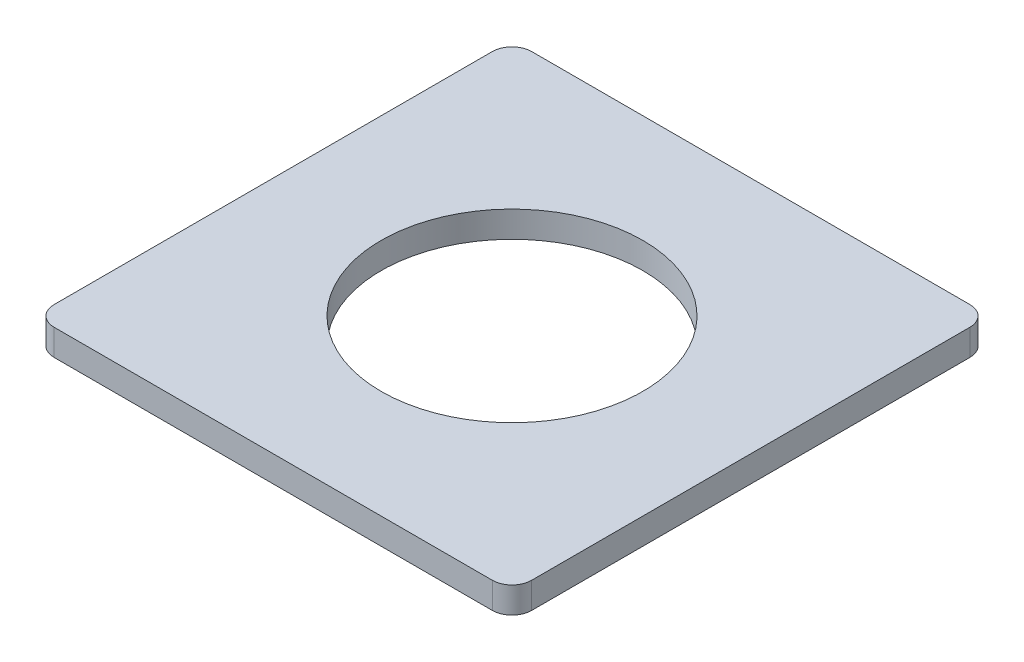
ISO-10303-21;
HEADER;
FILE_DESCRIPTION(('STEP AP214'),'2;1');
FILE_NAME('part.step','',(''),(''),'','','');
FILE_SCHEMA(('AUTOMOTIVE_DESIGN { 1 0 10303 214 1 1 1 1 }'));
ENDSEC;
DATA;
#1=APPLICATION_CONTEXT('core data for automotive mechanical design processes');
#2=APPLICATION_PROTOCOL_DEFINITION('international standard','automotive_design',2000,#1);
#3=PRODUCT_CONTEXT('',#1,'mechanical');
#4=PRODUCT('Part','Part','',(#3));
#5=PRODUCT_RELATED_PRODUCT_CATEGORY('part','',(#4));
#6=PRODUCT_DEFINITION_FORMATION('','',#4);
#7=PRODUCT_DEFINITION_CONTEXT('part definition',#1,'design');
#8=PRODUCT_DEFINITION('design','',#6,#7);
#9=PRODUCT_DEFINITION_SHAPE('','',#8);
#10=(LENGTH_UNIT() NAMED_UNIT(*) SI_UNIT(.MILLI.,.METRE.));
#11=(NAMED_UNIT(*) PLANE_ANGLE_UNIT() SI_UNIT($,.RADIAN.));
#12=(NAMED_UNIT(*) SI_UNIT($,.STERADIAN.) SOLID_ANGLE_UNIT());
#13=UNCERTAINTY_MEASURE_WITH_UNIT(LENGTH_MEASURE(1.E-05),#10,'distance_accuracy_value','');
#14=(GEOMETRIC_REPRESENTATION_CONTEXT(3) GLOBAL_UNCERTAINTY_ASSIGNED_CONTEXT((#13)) GLOBAL_UNIT_ASSIGNED_CONTEXT((#10,
#11,#12)) REPRESENTATION_CONTEXT('',''));
#15=CARTESIAN_POINT('',(0.,0.,0.));
#16=DIRECTION('',(0.,0.,1.));
#17=DIRECTION('',(1.,0.,0.));
#18=AXIS2_PLACEMENT_3D('',#15,#16,#17);
#19=CARTESIAN_POINT('',(0.,1.016,0.));
#20=DIRECTION('',(0.,-1.,0.));
#21=DIRECTION('',(0.,0.,-1.));
#22=AXIS2_PLACEMENT_3D('',#19,#20,#21);
#23=PLANE('',#22);
#24=DIRECTION('',(0.,0.,-1.));
#25=VECTOR('',#24,1.);
#26=CARTESIAN_POINT('',(9.271,1.016,9.271));
#27=LINE('',#26,#25);
#28=CARTESIAN_POINT('',(9.271,1.016,8.509));
#29=VERTEX_POINT('',#28);
#30=CARTESIAN_POINT('',(9.271,1.016,-8.509));
#31=VERTEX_POINT('',#30);
#32=EDGE_CURVE('E139',#29,#31,#27,.T.);
#33=ORIENTED_EDGE('',*,*,#32,.T.);
#34=CARTESIAN_POINT('',(8.509,1.016,-8.509));
#35=DIRECTION('',(0.,-1.,0.));
#36=DIRECTION('',(0.,0.,-1.));
#37=AXIS2_PLACEMENT_3D('',#34,#35,#36);
#38=CIRCLE('',#37,0.762);
#39=CARTESIAN_POINT('',(8.509,1.016,-9.271));
#40=VERTEX_POINT('',#39);
#41=EDGE_CURVE('E153',#31,#40,#38,.F.);
#42=ORIENTED_EDGE('',*,*,#41,.T.);
#43=DIRECTION('',(-1.,0.,0.));
#44=VECTOR('',#43,1.);
#45=CARTESIAN_POINT('',(-9.271,1.016,-9.271));
#46=LINE('',#45,#44);
#47=CARTESIAN_POINT('',(-8.509,1.016,-9.271));
#48=VERTEX_POINT('',#47);
#49=EDGE_CURVE('E120',#40,#48,#46,.T.);
#50=ORIENTED_EDGE('',*,*,#49,.T.);
#51=CARTESIAN_POINT('',(-8.509,1.016,-8.509));
#52=DIRECTION('',(0.,-1.,0.));
#53=DIRECTION('',(0.,0.,-1.));
#54=AXIS2_PLACEMENT_3D('',#51,#52,#53);
#55=CIRCLE('',#54,0.762);
#56=CARTESIAN_POINT('',(-9.271,1.016,-8.509));
#57=VERTEX_POINT('',#56);
#58=EDGE_CURVE('E149',#48,#57,#55,.F.);
#59=ORIENTED_EDGE('',*,*,#58,.T.);
#60=DIRECTION('',(0.,0.,1.));
#61=VECTOR('',#60,1.);
#62=CARTESIAN_POINT('',(-9.271,1.016,9.271));
#63=LINE('',#62,#61);
#64=CARTESIAN_POINT('',(-9.271,1.016,8.509));
#65=VERTEX_POINT('',#64);
#66=EDGE_CURVE('E162',#57,#65,#63,.T.);
#67=ORIENTED_EDGE('',*,*,#66,.T.);
#68=CARTESIAN_POINT('',(-8.509,1.016,8.509));
#69=DIRECTION('',(0.,-1.,0.));
#70=DIRECTION('',(0.,0.,-1.));
#71=AXIS2_PLACEMENT_3D('',#68,#69,#70);
#72=CIRCLE('',#71,0.762);
#73=CARTESIAN_POINT('',(-8.509,1.016,9.271));
#74=VERTEX_POINT('',#73);
#75=EDGE_CURVE('E55',#65,#74,#72,.F.);
#76=ORIENTED_EDGE('',*,*,#75,.T.);
#77=DIRECTION('',(1.,0.,0.));
#78=VECTOR('',#77,1.);
#79=CARTESIAN_POINT('',(-9.271,1.016,9.271));
#80=LINE('',#79,#78);
#81=CARTESIAN_POINT('',(8.509,1.016,9.271));
#82=VERTEX_POINT('',#81);
#83=EDGE_CURVE('E140',#74,#82,#80,.T.);
#84=ORIENTED_EDGE('',*,*,#83,.T.);
#85=CARTESIAN_POINT('',(8.509,1.016,8.509));
#86=DIRECTION('',(0.,-1.,0.));
#87=DIRECTION('',(0.,0.,-1.));
#88=AXIS2_PLACEMENT_3D('',#85,#86,#87);
#89=CIRCLE('',#88,0.762);
#90=EDGE_CURVE('E151',#82,#29,#89,.F.);
#91=ORIENTED_EDGE('',*,*,#90,.T.);
#92=EDGE_LOOP('',(#33,#42,#50,#59,#67,#76,#84,#91));
#93=FACE_BOUND('',#92,.T.);
#94=CARTESIAN_POINT('',(0.,1.016,0.));
#95=DIRECTION('',(0.,1.,0.));
#96=DIRECTION('',(0.,0.,1.));
#97=AXIS2_PLACEMENT_3D('',#94,#95,#96);
#98=CIRCLE('',#97,5.08);
#99=CARTESIAN_POINT('',(0.,1.016,5.08));
#100=VERTEX_POINT('',#99);
#101=EDGE_CURVE('E134',#100,#100,#98,.T.);
#102=ORIENTED_EDGE('',*,*,#101,.F.);
#103=EDGE_LOOP('',(#102));
#104=FACE_BOUND('',#103,.T.);
#105=ADVANCED_FACE('F33',(#93,#104),#23,.F.);
#106=CARTESIAN_POINT('',(0.,0.,0.));
#107=DIRECTION('',(0.,-1.,0.));
#108=DIRECTION('',(0.,0.,-1.));
#109=AXIS2_PLACEMENT_3D('',#106,#107,#108);
#110=PLANE('',#109);
#111=DIRECTION('',(-1.,0.,0.));
#112=VECTOR('',#111,1.);
#113=CARTESIAN_POINT('',(-9.271,0.,-9.271));
#114=LINE('',#113,#112);
#115=CARTESIAN_POINT('',(8.509,0.,-9.271));
#116=VERTEX_POINT('',#115);
#117=CARTESIAN_POINT('',(-8.509,0.,-9.271));
#118=VERTEX_POINT('',#117);
#119=EDGE_CURVE('E117',#116,#118,#114,.T.);
#120=ORIENTED_EDGE('',*,*,#119,.F.);
#121=CARTESIAN_POINT('',(8.509,0.,-8.509));
#122=DIRECTION('',(0.,-1.,0.));
#123=DIRECTION('',(0.,0.,-1.));
#124=AXIS2_PLACEMENT_3D('',#121,#122,#123);
#125=CIRCLE('',#124,0.762);
#126=CARTESIAN_POINT('',(9.271,0.,-8.509));
#127=VERTEX_POINT('',#126);
#128=EDGE_CURVE('E100',#116,#127,#125,.T.);
#129=ORIENTED_EDGE('',*,*,#128,.T.);
#130=DIRECTION('',(0.,0.,-1.));
#131=VECTOR('',#130,1.);
#132=CARTESIAN_POINT('',(9.271,0.,9.271));
#133=LINE('',#132,#131);
#134=CARTESIAN_POINT('',(9.271,0.,8.509));
#135=VERTEX_POINT('',#134);
#136=EDGE_CURVE('E129',#135,#127,#133,.T.);
#137=ORIENTED_EDGE('',*,*,#136,.F.);
#138=CARTESIAN_POINT('',(8.509,0.,8.509));
#139=DIRECTION('',(0.,-1.,0.));
#140=DIRECTION('',(0.,0.,-1.));
#141=AXIS2_PLACEMENT_3D('',#138,#139,#140);
#142=CIRCLE('',#141,0.762);
#143=CARTESIAN_POINT('',(8.509,0.,9.271));
#144=VERTEX_POINT('',#143);
#145=EDGE_CURVE('E111',#135,#144,#142,.T.);
#146=ORIENTED_EDGE('',*,*,#145,.T.);
#147=DIRECTION('',(1.,0.,0.));
#148=VECTOR('',#147,1.);
#149=CARTESIAN_POINT('',(-9.271,0.,9.271));
#150=LINE('',#149,#148);
#151=CARTESIAN_POINT('',(-8.509,0.,9.271));
#152=VERTEX_POINT('',#151);
#153=EDGE_CURVE('E132',#152,#144,#150,.T.);
#154=ORIENTED_EDGE('',*,*,#153,.F.);
#155=CARTESIAN_POINT('',(-8.509,0.,8.509));
#156=DIRECTION('',(0.,-1.,0.));
#157=DIRECTION('',(0.,0.,-1.));
#158=AXIS2_PLACEMENT_3D('',#155,#156,#157);
#159=CIRCLE('',#158,0.762);
#160=CARTESIAN_POINT('',(-9.271,0.,8.509));
#161=VERTEX_POINT('',#160);
#162=EDGE_CURVE('E121',#152,#161,#159,.T.);
#163=ORIENTED_EDGE('',*,*,#162,.T.);
#164=DIRECTION('',(0.,0.,1.));
#165=VECTOR('',#164,1.);
#166=CARTESIAN_POINT('',(-9.271,0.,9.271));
#167=LINE('',#166,#165);
#168=CARTESIAN_POINT('',(-9.271,0.,-8.509));
#169=VERTEX_POINT('',#168);
#170=EDGE_CURVE('E128',#169,#161,#167,.T.);
#171=ORIENTED_EDGE('',*,*,#170,.F.);
#172=CARTESIAN_POINT('',(-8.509,0.,-8.509));
#173=DIRECTION('',(0.,-1.,0.));
#174=DIRECTION('',(0.,0.,-1.));
#175=AXIS2_PLACEMENT_3D('',#172,#173,#174);
#176=CIRCLE('',#175,0.762);
#177=EDGE_CURVE('E127',#169,#118,#176,.T.);
#178=ORIENTED_EDGE('',*,*,#177,.T.);
#179=EDGE_LOOP('',(#120,#129,#137,#146,#154,#163,#171,#178));
#180=FACE_BOUND('',#179,.T.);
#181=CARTESIAN_POINT('',(0.,0.,0.));
#182=DIRECTION('',(0.,1.,0.));
#183=DIRECTION('',(0.,0.,1.));
#184=AXIS2_PLACEMENT_3D('',#181,#182,#183);
#185=CIRCLE('',#184,5.08);
#186=CARTESIAN_POINT('',(0.,0.,5.08));
#187=VERTEX_POINT('',#186);
#188=EDGE_CURVE('E182',#187,#187,#185,.T.);
#189=ORIENTED_EDGE('',*,*,#188,.T.);
#190=EDGE_LOOP('',(#189));
#191=FACE_BOUND('',#190,.T.);
#192=ADVANCED_FACE('F124',(#180,#191),#110,.T.);
#193=CARTESIAN_POINT('',(9.271,1.016,9.271));
#194=DIRECTION('',(-1.,0.,0.));
#195=DIRECTION('',(0.,0.,1.));
#196=AXIS2_PLACEMENT_3D('',#193,#194,#195);
#197=PLANE('',#196);
#198=ORIENTED_EDGE('',*,*,#136,.T.);
#199=DIRECTION('',(0.,-1.,0.));
#200=VECTOR('',#199,1.);
#201=CARTESIAN_POINT('',(9.271,1.016,-8.509));
#202=LINE('',#201,#200);
#203=EDGE_CURVE('E105',#127,#31,#202,.F.);
#204=ORIENTED_EDGE('',*,*,#203,.T.);
#205=ORIENTED_EDGE('',*,*,#32,.F.);
#206=DIRECTION('',(0.,-1.,0.));
#207=VECTOR('',#206,1.);
#208=CARTESIAN_POINT('',(9.271,1.016,8.509));
#209=LINE('',#208,#207);
#210=EDGE_CURVE('E110',#29,#135,#209,.T.);
#211=ORIENTED_EDGE('',*,*,#210,.T.);
#212=EDGE_LOOP('',(#198,#204,#205,#211));
#213=FACE_BOUND('',#212,.T.);
#214=ADVANCED_FACE('F178',(#213),#197,.F.);
#215=CARTESIAN_POINT('',(-9.271,1.016,-9.271));
#216=DIRECTION('',(0.,0.,1.));
#217=DIRECTION('',(1.,0.,0.));
#218=AXIS2_PLACEMENT_3D('',#215,#216,#217);
#219=PLANE('',#218);
#220=ORIENTED_EDGE('',*,*,#49,.F.);
#221=DIRECTION('',(0.,-1.,0.));
#222=VECTOR('',#221,1.);
#223=CARTESIAN_POINT('',(8.509,1.016,-9.271));
#224=LINE('',#223,#222);
#225=EDGE_CURVE('E104',#40,#116,#224,.T.);
#226=ORIENTED_EDGE('',*,*,#225,.T.);
#227=ORIENTED_EDGE('',*,*,#119,.T.);
#228=DIRECTION('',(0.,-1.,0.));
#229=VECTOR('',#228,1.);
#230=CARTESIAN_POINT('',(-8.509,1.016,-9.271));
#231=LINE('',#230,#229);
#232=EDGE_CURVE('E122',#118,#48,#231,.F.);
#233=ORIENTED_EDGE('',*,*,#232,.T.);
#234=EDGE_LOOP('',(#220,#226,#227,#233));
#235=FACE_BOUND('',#234,.T.);
#236=ADVANCED_FACE('F116',(#235),#219,.F.);
#237=CARTESIAN_POINT('',(-9.271,1.016,9.271));
#238=DIRECTION('',(1.,0.,0.));
#239=DIRECTION('',(0.,0.,-1.));
#240=AXIS2_PLACEMENT_3D('',#237,#238,#239);
#241=PLANE('',#240);
#242=ORIENTED_EDGE('',*,*,#66,.F.);
#243=DIRECTION('',(0.,-1.,0.));
#244=VECTOR('',#243,1.);
#245=CARTESIAN_POINT('',(-9.271,1.016,-8.509));
#246=LINE('',#245,#244);
#247=EDGE_CURVE('E11',#57,#169,#246,.T.);
#248=ORIENTED_EDGE('',*,*,#247,.T.);
#249=ORIENTED_EDGE('',*,*,#170,.T.);
#250=DIRECTION('',(0.,-1.,0.));
#251=VECTOR('',#250,1.);
#252=CARTESIAN_POINT('',(-9.271,1.016,8.509));
#253=LINE('',#252,#251);
#254=EDGE_CURVE('E41',#161,#65,#253,.F.);
#255=ORIENTED_EDGE('',*,*,#254,.T.);
#256=EDGE_LOOP('',(#242,#248,#249,#255));
#257=FACE_BOUND('',#256,.T.);
#258=ADVANCED_FACE('F161',(#257),#241,.F.);
#259=CARTESIAN_POINT('',(-9.271,1.016,9.271));
#260=DIRECTION('',(0.,0.,-1.));
#261=DIRECTION('',(-1.,0.,0.));
#262=AXIS2_PLACEMENT_3D('',#259,#260,#261);
#263=PLANE('',#262);
#264=ORIENTED_EDGE('',*,*,#153,.T.);
#265=DIRECTION('',(0.,-1.,0.));
#266=VECTOR('',#265,1.);
#267=CARTESIAN_POINT('',(8.509,1.016,9.271));
#268=LINE('',#267,#266);
#269=EDGE_CURVE('E48',#144,#82,#268,.F.);
#270=ORIENTED_EDGE('',*,*,#269,.T.);
#271=ORIENTED_EDGE('',*,*,#83,.F.);
#272=DIRECTION('',(0.,-1.,0.));
#273=VECTOR('',#272,1.);
#274=CARTESIAN_POINT('',(-8.509,1.016,9.271));
#275=LINE('',#274,#273);
#276=EDGE_CURVE('E155',#74,#152,#275,.T.);
#277=ORIENTED_EDGE('',*,*,#276,.T.);
#278=EDGE_LOOP('',(#264,#270,#271,#277));
#279=FACE_BOUND('',#278,.T.);
#280=ADVANCED_FACE('F171',(#279),#263,.F.);
#281=CARTESIAN_POINT('',(0.,1.016,0.));
#282=DIRECTION('',(0.,-1.,0.));
#283=DIRECTION('',(0.,0.,-1.));
#284=AXIS2_PLACEMENT_3D('',#281,#282,#283);
#285=CYLINDRICAL_SURFACE('',#284,5.08);
#286=ORIENTED_EDGE('',*,*,#101,.T.);
#287=EDGE_LOOP('',(#286));
#288=FACE_BOUND('',#287,.T.);
#289=ORIENTED_EDGE('',*,*,#188,.F.);
#290=EDGE_LOOP('',(#289));
#291=FACE_BOUND('',#290,.T.);
#292=ADVANCED_FACE('F188',(#288,#291),#285,.F.);
#293=CARTESIAN_POINT('',(8.509,1.016,-8.509));
#294=DIRECTION('',(0.,-1.,0.));
#295=DIRECTION('',(0.,0.,-1.));
#296=AXIS2_PLACEMENT_3D('',#293,#294,#295);
#297=CYLINDRICAL_SURFACE('',#296,0.762);
#298=ORIENTED_EDGE('',*,*,#41,.F.);
#299=ORIENTED_EDGE('',*,*,#203,.F.);
#300=ORIENTED_EDGE('',*,*,#128,.F.);
#301=ORIENTED_EDGE('',*,*,#225,.F.);
#302=EDGE_LOOP('',(#298,#299,#300,#301));
#303=FACE_BOUND('',#302,.T.);
#304=ADVANCED_FACE('F103',(#303),#297,.T.);
#305=CARTESIAN_POINT('',(8.509,1.016,8.509));
#306=DIRECTION('',(0.,-1.,0.));
#307=DIRECTION('',(0.,0.,-1.));
#308=AXIS2_PLACEMENT_3D('',#305,#306,#307);
#309=CYLINDRICAL_SURFACE('',#308,0.762);
#310=ORIENTED_EDGE('',*,*,#90,.F.);
#311=ORIENTED_EDGE('',*,*,#269,.F.);
#312=ORIENTED_EDGE('',*,*,#145,.F.);
#313=ORIENTED_EDGE('',*,*,#210,.F.);
#314=EDGE_LOOP('',(#310,#311,#312,#313));
#315=FACE_BOUND('',#314,.T.);
#316=ADVANCED_FACE('F175',(#315),#309,.T.);
#317=CARTESIAN_POINT('',(-8.509,1.016,-8.509));
#318=DIRECTION('',(0.,-1.,0.));
#319=DIRECTION('',(0.,0.,-1.));
#320=AXIS2_PLACEMENT_3D('',#317,#318,#319);
#321=CYLINDRICAL_SURFACE('',#320,0.762);
#322=ORIENTED_EDGE('',*,*,#58,.F.);
#323=ORIENTED_EDGE('',*,*,#232,.F.);
#324=ORIENTED_EDGE('',*,*,#177,.F.);
#325=ORIENTED_EDGE('',*,*,#247,.F.);
#326=EDGE_LOOP('',(#322,#323,#324,#325));
#327=FACE_BOUND('',#326,.T.);
#328=ADVANCED_FACE('F209',(#327),#321,.T.);
#329=CARTESIAN_POINT('',(-8.509,1.016,8.509));
#330=DIRECTION('',(0.,-1.,0.));
#331=DIRECTION('',(0.,0.,-1.));
#332=AXIS2_PLACEMENT_3D('',#329,#330,#331);
#333=CYLINDRICAL_SURFACE('',#332,0.762);
#334=ORIENTED_EDGE('',*,*,#75,.F.);
#335=ORIENTED_EDGE('',*,*,#254,.F.);
#336=ORIENTED_EDGE('',*,*,#162,.F.);
#337=ORIENTED_EDGE('',*,*,#276,.F.);
#338=EDGE_LOOP('',(#334,#335,#336,#337));
#339=FACE_BOUND('',#338,.T.);
#340=ADVANCED_FACE('F35',(#339),#333,.T.);
#341=CLOSED_SHELL('',(#105,#192,#214,#236,#258,#280,#292,#304,#316,#328,#340));
#342=MANIFOLD_SOLID_BREP('B2',#341);
#343=ADVANCED_BREP_SHAPE_REPRESENTATION('',(#18,#342),#14);
#344=SHAPE_DEFINITION_REPRESENTATION(#9,#343);
ENDSEC;
END-ISO-10303-21;
